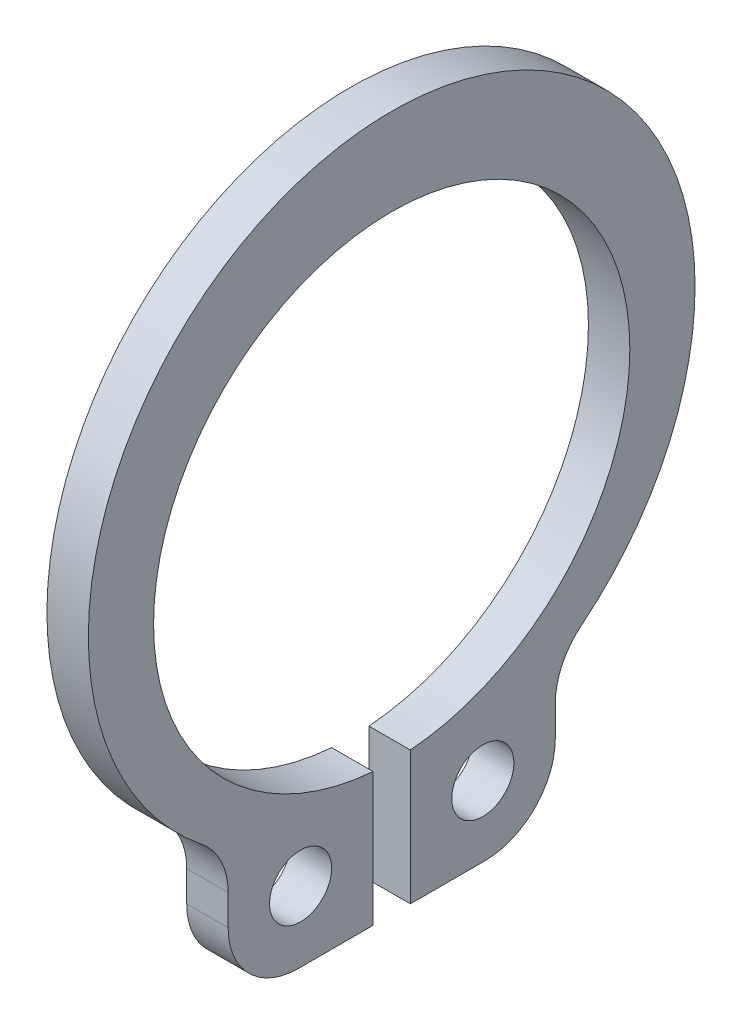
ISO-10303-21;
HEADER;
FILE_DESCRIPTION(('STEP AP214'),'2;1');
FILE_NAME('part.step','',(''),(''),'','','');
FILE_SCHEMA(('AUTOMOTIVE_DESIGN { 1 0 10303 214 1 1 1 1 }'));
ENDSEC;
DATA;
#1=APPLICATION_CONTEXT('core data for automotive mechanical design processes');
#2=APPLICATION_PROTOCOL_DEFINITION('international standard','automotive_design',2000,#1);
#3=PRODUCT_CONTEXT('',#1,'mechanical');
#4=PRODUCT('Part','Part','',(#3));
#5=PRODUCT_RELATED_PRODUCT_CATEGORY('part','',(#4));
#6=PRODUCT_DEFINITION_FORMATION('','',#4);
#7=PRODUCT_DEFINITION_CONTEXT('part definition',#1,'design');
#8=PRODUCT_DEFINITION('design','',#6,#7);
#9=PRODUCT_DEFINITION_SHAPE('','',#8);
#10=(LENGTH_UNIT() NAMED_UNIT(*) SI_UNIT(.MILLI.,.METRE.));
#11=(NAMED_UNIT(*) PLANE_ANGLE_UNIT() SI_UNIT($,.RADIAN.));
#12=(NAMED_UNIT(*) SI_UNIT($,.STERADIAN.) SOLID_ANGLE_UNIT());
#13=UNCERTAINTY_MEASURE_WITH_UNIT(LENGTH_MEASURE(1.E-05),#10,'distance_accuracy_value','');
#14=(GEOMETRIC_REPRESENTATION_CONTEXT(3) GLOBAL_UNCERTAINTY_ASSIGNED_CONTEXT((#13)) GLOBAL_UNIT_ASSIGNED_CONTEXT((#10,
#11,#12)) REPRESENTATION_CONTEXT('',''));
#15=CARTESIAN_POINT('',(0.,0.,0.));
#16=DIRECTION('',(0.,0.,1.));
#17=DIRECTION('',(1.,0.,0.));
#18=AXIS2_PLACEMENT_3D('',#15,#16,#17);
#19=CARTESIAN_POINT('',(-0.5,0.,0.));
#20=DIRECTION('',(1.,0.,0.));
#21=DIRECTION('',(0.,0.,-1.));
#22=AXIS2_PLACEMENT_3D('',#19,#20,#21);
#23=PLANE('',#22);
#24=CARTESIAN_POINT('',(-0.5,-7.24999999999999,2.2));
#25=DIRECTION('',(1.,0.,0.));
#26=DIRECTION('',(0.,0.,-1.));
#27=AXIS2_PLACEMENT_3D('',#24,#25,#26);
#28=CIRCLE('',#27,0.75);
#29=CARTESIAN_POINT('',(-0.5,-7.24999999999999,1.45));
#30=VERTEX_POINT('',#29);
#31=EDGE_CURVE('E175',#30,#30,#28,.T.);
#32=ORIENTED_EDGE('',*,*,#31,.T.);
#33=EDGE_LOOP('',(#32));
#34=FACE_BOUND('',#33,.T.);
#35=CARTESIAN_POINT('',(-0.5,-7.25,-2.2));
#36=DIRECTION('',(1.,0.,0.));
#37=DIRECTION('',(0.,0.,-1.));
#38=AXIS2_PLACEMENT_3D('',#35,#36,#37);
#39=CIRCLE('',#38,0.75);
#40=CARTESIAN_POINT('',(-0.5,-7.25,-2.95));
#41=VERTEX_POINT('',#40);
#42=EDGE_CURVE('E178',#41,#41,#39,.T.);
#43=ORIENTED_EDGE('',*,*,#42,.T.);
#44=EDGE_LOOP('',(#43));
#45=FACE_BOUND('',#44,.T.);
#46=CARTESIAN_POINT('',(-0.5,0.525,0.));
#47=DIRECTION('',(1.,0.,0.));
#48=DIRECTION('',(0.,0.,-1.));
#49=AXIS2_PLACEMENT_3D('',#46,#47,#48);
#50=CIRCLE('',#49,7.325);
#51=CARTESIAN_POINT('',(-0.5,-5.18697584209659,-4.58573407202216));
#52=VERTEX_POINT('',#51);
#53=CARTESIAN_POINT('',(-0.5,-5.18697584209659,4.58573407202216));
#54=VERTEX_POINT('',#53);
#55=EDGE_CURVE('E20',#52,#54,#50,.T.);
#56=ORIENTED_EDGE('',*,*,#55,.F.);
#57=CARTESIAN_POINT('',(-0.5,-6.5126221126173,-5.65));
#58=DIRECTION('',(1.,0.,0.));
#59=DIRECTION('',(0.,0.,-1.));
#60=AXIS2_PLACEMENT_3D('',#57,#58,#59);
#61=CIRCLE('',#60,1.7);
#62=CARTESIAN_POINT('',(-0.5,-6.5126221126173,-3.95));
#63=VERTEX_POINT('',#62);
#64=EDGE_CURVE('E181',#52,#63,#61,.T.);
#65=ORIENTED_EDGE('',*,*,#64,.T.);
#66=DIRECTION('',(0.,1.,0.));
#67=VECTOR('',#66,1.);
#68=CARTESIAN_POINT('',(-0.5,-7.25,-3.95));
#69=LINE('',#68,#67);
#70=CARTESIAN_POINT('',(-0.5,-7.25,-3.95));
#71=VERTEX_POINT('',#70);
#72=EDGE_CURVE('E122',#71,#63,#69,.T.);
#73=ORIENTED_EDGE('',*,*,#72,.F.);
#74=CARTESIAN_POINT('',(-0.5,-7.25,-2.25));
#75=DIRECTION('',(1.,0.,0.));
#76=DIRECTION('',(0.,0.,-1.));
#77=AXIS2_PLACEMENT_3D('',#74,#75,#76);
#78=CIRCLE('',#77,1.7);
#79=CARTESIAN_POINT('',(-0.5,-8.95,-2.25));
#80=VERTEX_POINT('',#79);
#81=EDGE_CURVE('E183',#80,#71,#78,.T.);
#82=ORIENTED_EDGE('',*,*,#81,.F.);
#83=DIRECTION('',(0.,0.,-1.));
#84=VECTOR('',#83,1.);
#85=CARTESIAN_POINT('',(-0.5,-8.95,-0.45));
#86=LINE('',#85,#84);
#87=CARTESIAN_POINT('',(-0.5,-8.95,-0.450000000000001));
#88=VERTEX_POINT('',#87);
#89=EDGE_CURVE('E126',#88,#80,#86,.T.);
#90=ORIENTED_EDGE('',*,*,#89,.F.);
#91=DIRECTION('',(0.,1.,0.));
#92=VECTOR('',#91,1.);
#93=CARTESIAN_POINT('',(-0.5,-5.7323642591866,-0.450000000000004));
#94=LINE('',#93,#92);
#95=CARTESIAN_POINT('',(-0.5,-5.7323642591866,-0.450000000000004));
#96=VERTEX_POINT('',#95);
#97=EDGE_CURVE('E133',#96,#88,#94,.F.);
#98=ORIENTED_EDGE('',*,*,#97,.F.);
#99=CARTESIAN_POINT('',(-0.5,0.,0.));
#100=DIRECTION('',(1.,0.,0.));
#101=DIRECTION('',(0.,0.,-1.));
#102=AXIS2_PLACEMENT_3D('',#99,#100,#101);
#103=CIRCLE('',#102,5.75);
#104=CARTESIAN_POINT('',(-0.5,-5.73236425918661,0.45));
#105=VERTEX_POINT('',#104);
#106=EDGE_CURVE('E136',#96,#105,#103,.T.);
#107=ORIENTED_EDGE('',*,*,#106,.T.);
#108=DIRECTION('',(0.,1.,0.));
#109=VECTOR('',#108,1.);
#110=CARTESIAN_POINT('',(-0.5,-8.95,0.45));
#111=LINE('',#110,#109);
#112=CARTESIAN_POINT('',(-0.5,-8.95,0.45));
#113=VERTEX_POINT('',#112);
#114=EDGE_CURVE('E139',#113,#105,#111,.T.);
#115=ORIENTED_EDGE('',*,*,#114,.F.);
#116=DIRECTION('',(0.,0.,-1.));
#117=VECTOR('',#116,1.);
#118=CARTESIAN_POINT('',(-0.5,-8.95,2.25));
#119=LINE('',#118,#117);
#120=CARTESIAN_POINT('',(-0.5,-8.95,2.25));
#121=VERTEX_POINT('',#120);
#122=EDGE_CURVE('E146',#121,#113,#119,.T.);
#123=ORIENTED_EDGE('',*,*,#122,.F.);
#124=CARTESIAN_POINT('',(-0.5,-7.25,2.25));
#125=DIRECTION('',(1.,0.,0.));
#126=DIRECTION('',(0.,0.,-1.));
#127=AXIS2_PLACEMENT_3D('',#124,#125,#126);
#128=CIRCLE('',#127,1.7);
#129=CARTESIAN_POINT('',(-0.5,-7.25,3.95));
#130=VERTEX_POINT('',#129);
#131=EDGE_CURVE('E188',#130,#121,#128,.T.);
#132=ORIENTED_EDGE('',*,*,#131,.F.);
#133=DIRECTION('',(0.,1.,0.));
#134=VECTOR('',#133,1.);
#135=CARTESIAN_POINT('',(-0.5,-6.51262211261731,3.95));
#136=LINE('',#135,#134);
#137=CARTESIAN_POINT('',(-0.5,-6.51262211261731,3.95));
#138=VERTEX_POINT('',#137);
#139=EDGE_CURVE('E111',#138,#130,#136,.F.);
#140=ORIENTED_EDGE('',*,*,#139,.F.);
#141=CARTESIAN_POINT('',(-0.5,-6.51262211261732,5.65000000000002));
#142=DIRECTION('',(1.,0.,0.));
#143=DIRECTION('',(0.,0.,-1.));
#144=AXIS2_PLACEMENT_3D('',#141,#142,#143);
#145=CIRCLE('',#144,1.70000000000002);
#146=EDGE_CURVE('E109',#138,#54,#145,.T.);
#147=ORIENTED_EDGE('',*,*,#146,.T.);
#148=EDGE_LOOP('',(#56,#65,#73,#82,#90,#98,#107,#115,#123,#132,#140,#147));
#149=FACE_BOUND('',#148,.T.);
#150=ADVANCED_FACE('F17',(#34,#45,#149),#23,.F.);
#151=CARTESIAN_POINT('',(0.5,0.525,0.));
#152=DIRECTION('',(1.,0.,0.));
#153=DIRECTION('',(0.,0.,-1.));
#154=AXIS2_PLACEMENT_3D('',#151,#152,#153);
#155=CYLINDRICAL_SURFACE('',#154,7.325);
#156=DIRECTION('',(1.,0.,0.));
#157=VECTOR('',#156,1.);
#158=CARTESIAN_POINT('',(0.5,-5.1869758420966,4.58573407202217));
#159=LINE('',#158,#157);
#160=CARTESIAN_POINT('',(0.5,-5.18697584209659,4.58573407202217));
#161=VERTEX_POINT('',#160);
#162=EDGE_CURVE('E101',#54,#161,#159,.T.);
#163=ORIENTED_EDGE('',*,*,#162,.T.);
#164=CARTESIAN_POINT('',(0.5,0.525,0.));
#165=DIRECTION('',(1.,0.,0.));
#166=DIRECTION('',(0.,0.,-1.));
#167=AXIS2_PLACEMENT_3D('',#164,#165,#166);
#168=CIRCLE('',#167,7.325);
#169=CARTESIAN_POINT('',(0.5,-5.18697584209659,-4.58573407202216));
#170=VERTEX_POINT('',#169);
#171=EDGE_CURVE('E173',#170,#161,#168,.T.);
#172=ORIENTED_EDGE('',*,*,#171,.F.);
#173=DIRECTION('',(1.,0.,0.));
#174=VECTOR('',#173,1.);
#175=CARTESIAN_POINT('',(0.5,-5.18697584209659,-4.58573407202216));
#176=LINE('',#175,#174);
#177=EDGE_CURVE('E104',#170,#52,#176,.F.);
#178=ORIENTED_EDGE('',*,*,#177,.T.);
#179=ORIENTED_EDGE('',*,*,#55,.T.);
#180=EDGE_LOOP('',(#163,#172,#178,#179));
#181=FACE_BOUND('',#180,.T.);
#182=ADVANCED_FACE('F99',(#181),#155,.T.);
#183=CARTESIAN_POINT('',(0.5,-6.51262211261732,5.65000000000002));
#184=DIRECTION('',(1.,0.,0.));
#185=DIRECTION('',(0.,0.,-1.));
#186=AXIS2_PLACEMENT_3D('',#183,#184,#185);
#187=CYLINDRICAL_SURFACE('',#186,1.70000000000002);
#188=DIRECTION('',(1.,0.,0.));
#189=VECTOR('',#188,1.);
#190=CARTESIAN_POINT('',(0.5,-6.51262211261731,3.95));
#191=LINE('',#190,#189);
#192=CARTESIAN_POINT('',(0.5,-6.51262211261731,3.95));
#193=VERTEX_POINT('',#192);
#194=EDGE_CURVE('E120',#193,#138,#191,.F.);
#195=ORIENTED_EDGE('',*,*,#194,.F.);
#196=CARTESIAN_POINT('',(0.5,-6.51262211261732,5.65000000000002));
#197=DIRECTION('',(1.,0.,0.));
#198=DIRECTION('',(0.,0.,-1.));
#199=AXIS2_PLACEMENT_3D('',#196,#197,#198);
#200=CIRCLE('',#199,1.70000000000002);
#201=EDGE_CURVE('E116',#161,#193,#200,.F.);
#202=ORIENTED_EDGE('',*,*,#201,.F.);
#203=ORIENTED_EDGE('',*,*,#162,.F.);
#204=ORIENTED_EDGE('',*,*,#146,.F.);
#205=EDGE_LOOP('',(#195,#202,#203,#204));
#206=FACE_BOUND('',#205,.T.);
#207=ADVANCED_FACE('F114',(#206),#187,.F.);
#208=CARTESIAN_POINT('',(0.5,-6.51262211261731,3.95));
#209=DIRECTION('',(0.,0.,1.));
#210=DIRECTION('',(1.,0.,0.));
#211=AXIS2_PLACEMENT_3D('',#208,#209,#210);
#212=PLANE('',#211);
#213=DIRECTION('',(0.,1.,0.));
#214=VECTOR('',#213,1.);
#215=CARTESIAN_POINT('',(0.5,0.,3.95));
#216=LINE('',#215,#214);
#217=CARTESIAN_POINT('',(0.5,-7.25,3.95));
#218=VERTEX_POINT('',#217);
#219=EDGE_CURVE('E171',#193,#218,#216,.F.);
#220=ORIENTED_EDGE('',*,*,#219,.F.);
#221=ORIENTED_EDGE('',*,*,#194,.T.);
#222=ORIENTED_EDGE('',*,*,#139,.T.);
#223=DIRECTION('',(1.,0.,0.));
#224=VECTOR('',#223,1.);
#225=CARTESIAN_POINT('',(0.5,-7.25,3.95));
#226=LINE('',#225,#224);
#227=EDGE_CURVE('E149',#218,#130,#226,.F.);
#228=ORIENTED_EDGE('',*,*,#227,.F.);
#229=EDGE_LOOP('',(#220,#221,#222,#228));
#230=FACE_BOUND('',#229,.T.);
#231=ADVANCED_FACE('F195',(#230),#212,.T.);
#232=CARTESIAN_POINT('',(0.5,-7.25,2.25));
#233=DIRECTION('',(1.,0.,0.));
#234=DIRECTION('',(0.,0.,-1.));
#235=AXIS2_PLACEMENT_3D('',#232,#233,#234);
#236=CYLINDRICAL_SURFACE('',#235,1.7);
#237=CARTESIAN_POINT('',(0.5,-7.25,2.25));
#238=DIRECTION('',(1.,0.,0.));
#239=DIRECTION('',(0.,0.,-1.));
#240=AXIS2_PLACEMENT_3D('',#237,#238,#239);
#241=CIRCLE('',#240,1.7);
#242=CARTESIAN_POINT('',(0.5,-8.95,2.25));
#243=VERTEX_POINT('',#242);
#244=EDGE_CURVE('E167',#218,#243,#241,.T.);
#245=ORIENTED_EDGE('',*,*,#244,.F.);
#246=ORIENTED_EDGE('',*,*,#227,.T.);
#247=ORIENTED_EDGE('',*,*,#131,.T.);
#248=DIRECTION('',(1.,0.,0.));
#249=VECTOR('',#248,1.);
#250=CARTESIAN_POINT('',(0.5,-8.95,2.25));
#251=LINE('',#250,#249);
#252=EDGE_CURVE('E143',#243,#121,#251,.F.);
#253=ORIENTED_EDGE('',*,*,#252,.F.);
#254=EDGE_LOOP('',(#245,#246,#247,#253));
#255=FACE_BOUND('',#254,.T.);
#256=ADVANCED_FACE('F227',(#255),#236,.T.);
#257=CARTESIAN_POINT('',(0.5,-8.95,2.25));
#258=DIRECTION('',(0.,-1.,0.));
#259=DIRECTION('',(0.,0.,-1.));
#260=AXIS2_PLACEMENT_3D('',#257,#258,#259);
#261=PLANE('',#260);
#262=DIRECTION('',(0.,0.,-1.));
#263=VECTOR('',#262,1.);
#264=CARTESIAN_POINT('',(0.5,-8.95,0.));
#265=LINE('',#264,#263);
#266=CARTESIAN_POINT('',(0.5,-8.95,0.45));
#267=VERTEX_POINT('',#266);
#268=EDGE_CURVE('E170',#243,#267,#265,.T.);
#269=ORIENTED_EDGE('',*,*,#268,.F.);
#270=ORIENTED_EDGE('',*,*,#252,.T.);
#271=ORIENTED_EDGE('',*,*,#122,.T.);
#272=DIRECTION('',(1.,0.,0.));
#273=VECTOR('',#272,1.);
#274=CARTESIAN_POINT('',(0.5,-8.95,0.45));
#275=LINE('',#274,#273);
#276=EDGE_CURVE('E142',#267,#113,#275,.F.);
#277=ORIENTED_EDGE('',*,*,#276,.F.);
#278=EDGE_LOOP('',(#269,#270,#271,#277));
#279=FACE_BOUND('',#278,.T.);
#280=ADVANCED_FACE('F224',(#279),#261,.T.);
#281=CARTESIAN_POINT('',(0.5,-8.95,0.45));
#282=DIRECTION('',(0.,0.,-1.));
#283=DIRECTION('',(0.,1.,0.));
#284=AXIS2_PLACEMENT_3D('',#281,#282,#283);
#285=PLANE('',#284);
#286=DIRECTION('',(0.,1.,0.));
#287=VECTOR('',#286,1.);
#288=CARTESIAN_POINT('',(0.5,0.,0.45));
#289=LINE('',#288,#287);
#290=CARTESIAN_POINT('',(0.5,-5.73236425918661,0.450000000000001));
#291=VERTEX_POINT('',#290);
#292=EDGE_CURVE('E166',#267,#291,#289,.T.);
#293=ORIENTED_EDGE('',*,*,#292,.F.);
#294=ORIENTED_EDGE('',*,*,#276,.T.);
#295=ORIENTED_EDGE('',*,*,#114,.T.);
#296=DIRECTION('',(1.,0.,0.));
#297=VECTOR('',#296,1.);
#298=CARTESIAN_POINT('',(0.5,-5.73236425918661,0.450000000000001));
#299=LINE('',#298,#297);
#300=EDGE_CURVE('E187',#105,#291,#299,.T.);
#301=ORIENTED_EDGE('',*,*,#300,.T.);
#302=EDGE_LOOP('',(#293,#294,#295,#301));
#303=FACE_BOUND('',#302,.T.);
#304=ADVANCED_FACE('F267',(#303),#285,.T.);
#305=CARTESIAN_POINT('',(0.5,0.,0.));
#306=DIRECTION('',(1.,0.,0.));
#307=DIRECTION('',(0.,0.,-1.));
#308=AXIS2_PLACEMENT_3D('',#305,#306,#307);
#309=CYLINDRICAL_SURFACE('',#308,5.75);
#310=ORIENTED_EDGE('',*,*,#106,.F.);
#311=DIRECTION('',(1.,0.,0.));
#312=VECTOR('',#311,1.);
#313=CARTESIAN_POINT('',(0.5,-5.7323642591866,-0.450000000000004));
#314=LINE('',#313,#312);
#315=CARTESIAN_POINT('',(0.5,-5.7323642591866,-0.450000000000004));
#316=VERTEX_POINT('',#315);
#317=EDGE_CURVE('E130',#316,#96,#314,.F.);
#318=ORIENTED_EDGE('',*,*,#317,.F.);
#319=CARTESIAN_POINT('',(0.5,0.,0.));
#320=DIRECTION('',(1.,0.,0.));
#321=DIRECTION('',(0.,0.,-1.));
#322=AXIS2_PLACEMENT_3D('',#319,#320,#321);
#323=CIRCLE('',#322,5.75);
#324=EDGE_CURVE('E163',#291,#316,#323,.F.);
#325=ORIENTED_EDGE('',*,*,#324,.F.);
#326=ORIENTED_EDGE('',*,*,#300,.F.);
#327=EDGE_LOOP('',(#310,#318,#325,#326));
#328=FACE_BOUND('',#327,.T.);
#329=ADVANCED_FACE('F264',(#328),#309,.F.);
#330=CARTESIAN_POINT('',(0.5,-5.7323642591866,-0.450000000000004));
#331=DIRECTION('',(0.,0.,1.));
#332=DIRECTION('',(1.,0.,0.));
#333=AXIS2_PLACEMENT_3D('',#330,#331,#332);
#334=PLANE('',#333);
#335=DIRECTION('',(0.,1.,0.));
#336=VECTOR('',#335,1.);
#337=CARTESIAN_POINT('',(0.5,0.,-0.450000000000004));
#338=LINE('',#337,#336);
#339=CARTESIAN_POINT('',(0.5,-8.95,-0.450000000000003));
#340=VERTEX_POINT('',#339);
#341=EDGE_CURVE('E165',#316,#340,#338,.F.);
#342=ORIENTED_EDGE('',*,*,#341,.F.);
#343=ORIENTED_EDGE('',*,*,#317,.T.);
#344=ORIENTED_EDGE('',*,*,#97,.T.);
#345=DIRECTION('',(1.,0.,0.));
#346=VECTOR('',#345,1.);
#347=CARTESIAN_POINT('',(0.5,-8.95,-0.45));
#348=LINE('',#347,#346);
#349=EDGE_CURVE('E129',#340,#88,#348,.F.);
#350=ORIENTED_EDGE('',*,*,#349,.F.);
#351=EDGE_LOOP('',(#342,#343,#344,#350));
#352=FACE_BOUND('',#351,.T.);
#353=ADVANCED_FACE('F257',(#352),#334,.T.);
#354=CARTESIAN_POINT('',(0.5,-8.95,-0.45));
#355=DIRECTION('',(0.,-1.,0.));
#356=DIRECTION('',(0.,0.,-1.));
#357=AXIS2_PLACEMENT_3D('',#354,#355,#356);
#358=PLANE('',#357);
#359=DIRECTION('',(0.,0.,-1.));
#360=VECTOR('',#359,1.);
#361=CARTESIAN_POINT('',(0.5,-8.95,0.));
#362=LINE('',#361,#360);
#363=CARTESIAN_POINT('',(0.5,-8.95,-2.25));
#364=VERTEX_POINT('',#363);
#365=EDGE_CURVE('E162',#340,#364,#362,.T.);
#366=ORIENTED_EDGE('',*,*,#365,.F.);
#367=ORIENTED_EDGE('',*,*,#349,.T.);
#368=ORIENTED_EDGE('',*,*,#89,.T.);
#369=DIRECTION('',(1.,0.,0.));
#370=VECTOR('',#369,1.);
#371=CARTESIAN_POINT('',(0.5,-8.95,-2.25));
#372=LINE('',#371,#370);
#373=EDGE_CURVE('E125',#364,#80,#372,.F.);
#374=ORIENTED_EDGE('',*,*,#373,.F.);
#375=EDGE_LOOP('',(#366,#367,#368,#374));
#376=FACE_BOUND('',#375,.T.);
#377=ADVANCED_FACE('F252',(#376),#358,.T.);
#378=CARTESIAN_POINT('',(0.5,-7.25,-2.25));
#379=DIRECTION('',(1.,0.,0.));
#380=DIRECTION('',(0.,0.,-1.));
#381=AXIS2_PLACEMENT_3D('',#378,#379,#380);
#382=CYLINDRICAL_SURFACE('',#381,1.7);
#383=CARTESIAN_POINT('',(0.5,-7.25,-2.25));
#384=DIRECTION('',(1.,0.,0.));
#385=DIRECTION('',(0.,0.,-1.));
#386=AXIS2_PLACEMENT_3D('',#383,#384,#385);
#387=CIRCLE('',#386,1.7);
#388=CARTESIAN_POINT('',(0.5,-7.25,-3.95));
#389=VERTEX_POINT('',#388);
#390=EDGE_CURVE('E159',#364,#389,#387,.T.);
#391=ORIENTED_EDGE('',*,*,#390,.F.);
#392=ORIENTED_EDGE('',*,*,#373,.T.);
#393=ORIENTED_EDGE('',*,*,#81,.T.);
#394=DIRECTION('',(-1.,0.,0.));
#395=VECTOR('',#394,1.);
#396=CARTESIAN_POINT('',(0.5,-7.25,-3.95));
#397=LINE('',#396,#395);
#398=EDGE_CURVE('E124',#389,#71,#397,.T.);
#399=ORIENTED_EDGE('',*,*,#398,.F.);
#400=EDGE_LOOP('',(#391,#392,#393,#399));
#401=FACE_BOUND('',#400,.T.);
#402=ADVANCED_FACE('F248',(#401),#382,.T.);
#403=CARTESIAN_POINT('',(0.5,-7.25,-3.95));
#404=DIRECTION('',(0.,0.,-1.));
#405=DIRECTION('',(-1.,0.,0.));
#406=AXIS2_PLACEMENT_3D('',#403,#404,#405);
#407=PLANE('',#406);
#408=DIRECTION('',(0.,1.,0.));
#409=VECTOR('',#408,1.);
#410=CARTESIAN_POINT('',(0.5,0.,-3.95));
#411=LINE('',#410,#409);
#412=CARTESIAN_POINT('',(0.5,-6.5126221126173,-3.95));
#413=VERTEX_POINT('',#412);
#414=EDGE_CURVE('E158',#389,#413,#411,.T.);
#415=ORIENTED_EDGE('',*,*,#414,.F.);
#416=ORIENTED_EDGE('',*,*,#398,.T.);
#417=ORIENTED_EDGE('',*,*,#72,.T.);
#418=DIRECTION('',(1.,0.,0.));
#419=VECTOR('',#418,1.);
#420=CARTESIAN_POINT('',(0.5,-6.5126221126173,-3.95));
#421=LINE('',#420,#419);
#422=EDGE_CURVE('E35',#63,#413,#421,.T.);
#423=ORIENTED_EDGE('',*,*,#422,.T.);
#424=EDGE_LOOP('',(#415,#416,#417,#423));
#425=FACE_BOUND('',#424,.T.);
#426=ADVANCED_FACE('F246',(#425),#407,.T.);
#427=CARTESIAN_POINT('',(0.5,-6.5126221126173,-5.65));
#428=DIRECTION('',(1.,0.,0.));
#429=DIRECTION('',(0.,0.,-1.));
#430=AXIS2_PLACEMENT_3D('',#427,#428,#429);
#431=CYLINDRICAL_SURFACE('',#430,1.7);
#432=ORIENTED_EDGE('',*,*,#177,.F.);
#433=CARTESIAN_POINT('',(0.5,-6.5126221126173,-5.65));
#434=DIRECTION('',(1.,0.,0.));
#435=DIRECTION('',(0.,0.,-1.));
#436=AXIS2_PLACEMENT_3D('',#433,#434,#435);
#437=CIRCLE('',#436,1.7);
#438=EDGE_CURVE('E155',#413,#170,#437,.F.);
#439=ORIENTED_EDGE('',*,*,#438,.F.);
#440=ORIENTED_EDGE('',*,*,#422,.F.);
#441=ORIENTED_EDGE('',*,*,#64,.F.);
#442=EDGE_LOOP('',(#432,#439,#440,#441));
#443=FACE_BOUND('',#442,.T.);
#444=ADVANCED_FACE('F203',(#443),#431,.F.);
#445=CARTESIAN_POINT('',(0.5,-7.25,-2.2));
#446=DIRECTION('',(1.,0.,0.));
#447=DIRECTION('',(0.,0.,-1.));
#448=AXIS2_PLACEMENT_3D('',#445,#446,#447);
#449=CYLINDRICAL_SURFACE('',#448,0.75);
#450=ORIENTED_EDGE('',*,*,#42,.F.);
#451=EDGE_LOOP('',(#450));
#452=FACE_BOUND('',#451,.T.);
#453=CARTESIAN_POINT('',(0.5,-7.25,-2.2));
#454=DIRECTION('',(1.,0.,0.));
#455=DIRECTION('',(0.,0.,-1.));
#456=AXIS2_PLACEMENT_3D('',#453,#454,#455);
#457=CIRCLE('',#456,0.75);
#458=CARTESIAN_POINT('',(0.5,-7.25,-2.95));
#459=VERTEX_POINT('',#458);
#460=EDGE_CURVE('E26',#459,#459,#457,.F.);
#461=ORIENTED_EDGE('',*,*,#460,.F.);
#462=EDGE_LOOP('',(#461));
#463=FACE_BOUND('',#462,.T.);
#464=ADVANCED_FACE('F284',(#452,#463),#449,.F.);
#465=CARTESIAN_POINT('',(0.5,-7.24999999999999,2.2));
#466=DIRECTION('',(1.,0.,0.));
#467=DIRECTION('',(0.,0.,-1.));
#468=AXIS2_PLACEMENT_3D('',#465,#466,#467);
#469=CYLINDRICAL_SURFACE('',#468,0.75);
#470=ORIENTED_EDGE('',*,*,#31,.F.);
#471=EDGE_LOOP('',(#470));
#472=FACE_BOUND('',#471,.T.);
#473=CARTESIAN_POINT('',(0.5,-7.24999999999999,2.2));
#474=DIRECTION('',(1.,0.,0.));
#475=DIRECTION('',(0.,0.,-1.));
#476=AXIS2_PLACEMENT_3D('',#473,#474,#475);
#477=CIRCLE('',#476,0.75);
#478=CARTESIAN_POINT('',(0.5,-7.24999999999999,1.45));
#479=VERTEX_POINT('',#478);
#480=EDGE_CURVE('E11',#479,#479,#477,.F.);
#481=ORIENTED_EDGE('',*,*,#480,.F.);
#482=EDGE_LOOP('',(#481));
#483=FACE_BOUND('',#482,.T.);
#484=ADVANCED_FACE('F278',(#472,#483),#469,.F.);
#485=CARTESIAN_POINT('',(0.5,0.,0.));
#486=DIRECTION('',(1.,0.,0.));
#487=DIRECTION('',(0.,0.,-1.));
#488=AXIS2_PLACEMENT_3D('',#485,#486,#487);
#489=PLANE('',#488);
#490=ORIENTED_EDGE('',*,*,#480,.T.);
#491=EDGE_LOOP('',(#490));
#492=FACE_BOUND('',#491,.T.);
#493=ORIENTED_EDGE('',*,*,#460,.T.);
#494=EDGE_LOOP('',(#493));
#495=FACE_BOUND('',#494,.T.);
#496=ORIENTED_EDGE('',*,*,#414,.T.);
#497=ORIENTED_EDGE('',*,*,#438,.T.);
#498=ORIENTED_EDGE('',*,*,#171,.T.);
#499=ORIENTED_EDGE('',*,*,#201,.T.);
#500=ORIENTED_EDGE('',*,*,#219,.T.);
#501=ORIENTED_EDGE('',*,*,#244,.T.);
#502=ORIENTED_EDGE('',*,*,#268,.T.);
#503=ORIENTED_EDGE('',*,*,#292,.T.);
#504=ORIENTED_EDGE('',*,*,#324,.T.);
#505=ORIENTED_EDGE('',*,*,#341,.T.);
#506=ORIENTED_EDGE('',*,*,#365,.T.);
#507=ORIENTED_EDGE('',*,*,#390,.T.);
#508=EDGE_LOOP('',(#496,#497,#498,#499,#500,#501,#502,#503,#504,#505,#506,#507));
#509=FACE_BOUND('',#508,.T.);
#510=ADVANCED_FACE('F201',(#492,#495,#509),#489,.T.);
#511=CLOSED_SHELL('',(#150,#182,#207,#231,#256,#280,#304,#329,#353,#377,#402,#426,#444,#464,
#484,#510));
#512=MANIFOLD_SOLID_BREP('B1',#511);
#513=ADVANCED_BREP_SHAPE_REPRESENTATION('',(#18,#512),#14);
#514=SHAPE_DEFINITION_REPRESENTATION(#9,#513);
ENDSEC;
END-ISO-10303-21;
